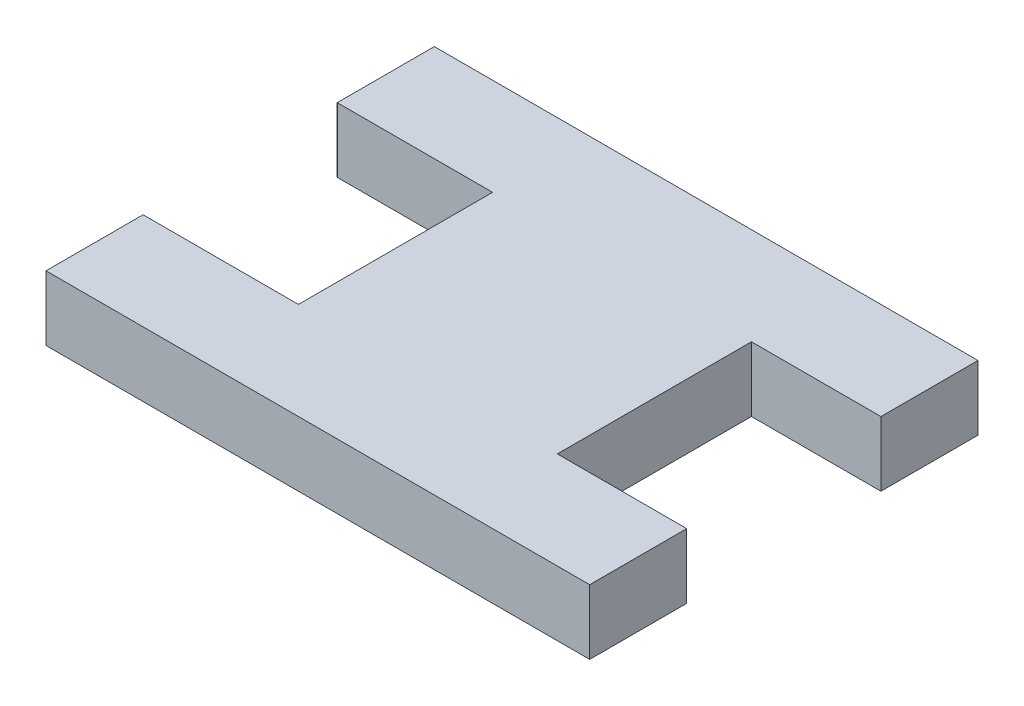
ISO-10303-21;
HEADER;
FILE_DESCRIPTION(('STEP AP214'),'2;1');
FILE_NAME('part.step','',(''),(''),'','','');
FILE_SCHEMA(('AUTOMOTIVE_DESIGN { 1 0 10303 214 1 1 1 1 }'));
ENDSEC;
DATA;
#1=APPLICATION_CONTEXT('core data for automotive mechanical design processes');
#2=APPLICATION_PROTOCOL_DEFINITION('international standard','automotive_design',2000,#1);
#3=PRODUCT_CONTEXT('',#1,'mechanical');
#4=PRODUCT('Part','Part','',(#3));
#5=PRODUCT_RELATED_PRODUCT_CATEGORY('part','',(#4));
#6=PRODUCT_DEFINITION_FORMATION('','',#4);
#7=PRODUCT_DEFINITION_CONTEXT('part definition',#1,'design');
#8=PRODUCT_DEFINITION('design','',#6,#7);
#9=PRODUCT_DEFINITION_SHAPE('','',#8);
#10=(LENGTH_UNIT() NAMED_UNIT(*) SI_UNIT(.MILLI.,.METRE.));
#11=(NAMED_UNIT(*) PLANE_ANGLE_UNIT() SI_UNIT($,.RADIAN.));
#12=(NAMED_UNIT(*) SI_UNIT($,.STERADIAN.) SOLID_ANGLE_UNIT());
#13=UNCERTAINTY_MEASURE_WITH_UNIT(LENGTH_MEASURE(1.E-05),#10,'distance_accuracy_value','');
#14=(GEOMETRIC_REPRESENTATION_CONTEXT(3) GLOBAL_UNCERTAINTY_ASSIGNED_CONTEXT((#13)) GLOBAL_UNIT_ASSIGNED_CONTEXT((#10,
#11,#12)) REPRESENTATION_CONTEXT('',''));
#15=CARTESIAN_POINT('',(0.,0.,0.));
#16=DIRECTION('',(0.,0.,1.));
#17=DIRECTION('',(1.,0.,0.));
#18=AXIS2_PLACEMENT_3D('',#15,#16,#17);
#19=CARTESIAN_POINT('',(0.,10.,0.));
#20=DIRECTION('',(0.,1.,0.));
#21=DIRECTION('',(0.,0.,1.));
#22=AXIS2_PLACEMENT_3D('',#19,#20,#21);
#23=PLANE('',#22);
#24=DIRECTION('',(0.,0.,1.));
#25=VECTOR('',#24,1.);
#26=CARTESIAN_POINT('',(-22.5,10.,-15.));
#27=LINE('',#26,#25);
#28=CARTESIAN_POINT('',(-22.5,10.,-15.));
#29=VERTEX_POINT('',#28);
#30=CARTESIAN_POINT('',(-22.5,10.,-7.5));
#31=VERTEX_POINT('',#30);
#32=EDGE_CURVE('E142',#29,#31,#27,.T.);
#33=ORIENTED_EDGE('',*,*,#32,.T.);
#34=DIRECTION('',(1.,0.,0.));
#35=VECTOR('',#34,1.);
#36=CARTESIAN_POINT('',(-22.5,10.,-7.5));
#37=LINE('',#36,#35);
#38=CARTESIAN_POINT('',(-10.5,10.,-7.50000000000001));
#39=VERTEX_POINT('',#38);
#40=EDGE_CURVE('E185',#31,#39,#37,.T.);
#41=ORIENTED_EDGE('',*,*,#40,.T.);
#42=DIRECTION('',(0.,0.,1.));
#43=VECTOR('',#42,1.);
#44=CARTESIAN_POINT('',(-10.5,10.,-7.50000000000001));
#45=LINE('',#44,#43);
#46=CARTESIAN_POINT('',(-10.5,10.,7.50000000000001));
#47=VERTEX_POINT('',#46);
#48=EDGE_CURVE('E182',#39,#47,#45,.T.);
#49=ORIENTED_EDGE('',*,*,#48,.T.);
#50=DIRECTION('',(-1.,0.,0.));
#51=VECTOR('',#50,1.);
#52=CARTESIAN_POINT('',(-22.5,10.,7.5));
#53=LINE('',#52,#51);
#54=CARTESIAN_POINT('',(-22.5,10.,7.5));
#55=VERTEX_POINT('',#54);
#56=EDGE_CURVE('E213',#47,#55,#53,.T.);
#57=ORIENTED_EDGE('',*,*,#56,.T.);
#58=DIRECTION('',(0.,0.,1.));
#59=VECTOR('',#58,1.);
#60=CARTESIAN_POINT('',(-22.5,10.,15.));
#61=LINE('',#60,#59);
#62=CARTESIAN_POINT('',(-22.5,10.,15.));
#63=VERTEX_POINT('',#62);
#64=EDGE_CURVE('E215',#55,#63,#61,.T.);
#65=ORIENTED_EDGE('',*,*,#64,.T.);
#66=DIRECTION('',(1.,0.,0.));
#67=VECTOR('',#66,1.);
#68=CARTESIAN_POINT('',(-22.5,10.,15.));
#69=LINE('',#68,#67);
#70=CARTESIAN_POINT('',(19.5,10.,15.));
#71=VERTEX_POINT('',#70);
#72=EDGE_CURVE('E217',#63,#71,#69,.T.);
#73=ORIENTED_EDGE('',*,*,#72,.T.);
#74=DIRECTION('',(0.,0.,-1.));
#75=VECTOR('',#74,1.);
#76=CARTESIAN_POINT('',(19.5,10.,15.));
#77=LINE('',#76,#75);
#78=CARTESIAN_POINT('',(19.5,10.,7.5));
#79=VERTEX_POINT('',#78);
#80=EDGE_CURVE('E219',#71,#79,#77,.T.);
#81=ORIENTED_EDGE('',*,*,#80,.T.);
#82=DIRECTION('',(-1.,0.,0.));
#83=VECTOR('',#82,1.);
#84=CARTESIAN_POINT('',(19.5,10.,7.5));
#85=LINE('',#84,#83);
#86=CARTESIAN_POINT('',(9.50000000000001,10.,7.5));
#87=VERTEX_POINT('',#86);
#88=EDGE_CURVE('E221',#79,#87,#85,.T.);
#89=ORIENTED_EDGE('',*,*,#88,.T.);
#90=DIRECTION('',(0.,0.,-1.));
#91=VECTOR('',#90,1.);
#92=CARTESIAN_POINT('',(9.50000000000001,10.,-7.5));
#93=LINE('',#92,#91);
#94=CARTESIAN_POINT('',(9.50000000000001,10.,-7.5));
#95=VERTEX_POINT('',#94);
#96=EDGE_CURVE('E223',#87,#95,#93,.T.);
#97=ORIENTED_EDGE('',*,*,#96,.T.);
#98=DIRECTION('',(1.,0.,0.));
#99=VECTOR('',#98,1.);
#100=CARTESIAN_POINT('',(19.5,10.,-7.5));
#101=LINE('',#100,#99);
#102=CARTESIAN_POINT('',(19.5,10.,-7.5));
#103=VERTEX_POINT('',#102);
#104=EDGE_CURVE('E225',#95,#103,#101,.T.);
#105=ORIENTED_EDGE('',*,*,#104,.T.);
#106=DIRECTION('',(0.,0.,-1.));
#107=VECTOR('',#106,1.);
#108=CARTESIAN_POINT('',(19.5,10.,-15.));
#109=LINE('',#108,#107);
#110=CARTESIAN_POINT('',(19.5,10.,-15.));
#111=VERTEX_POINT('',#110);
#112=EDGE_CURVE('E146',#103,#111,#109,.T.);
#113=ORIENTED_EDGE('',*,*,#112,.T.);
#114=DIRECTION('',(-1.,0.,0.));
#115=VECTOR('',#114,1.);
#116=CARTESIAN_POINT('',(-22.5,10.,-15.));
#117=LINE('',#116,#115);
#118=EDGE_CURVE('E60',#111,#29,#117,.T.);
#119=ORIENTED_EDGE('',*,*,#118,.T.);
#120=EDGE_LOOP('',(#33,#41,#49,#57,#65,#73,#81,#89,#97,#105,#113,#119));
#121=FACE_BOUND('',#120,.T.);
#122=ADVANCED_FACE('F37',(#121),#23,.T.);
#123=CARTESIAN_POINT('',(-22.5,10.,15.));
#124=DIRECTION('',(1.,0.,0.));
#125=DIRECTION('',(0.,0.,-1.));
#126=AXIS2_PLACEMENT_3D('',#123,#124,#125);
#127=PLANE('',#126);
#128=DIRECTION('',(0.,0.,1.));
#129=VECTOR('',#128,1.);
#130=CARTESIAN_POINT('',(-22.5,5.,15.));
#131=LINE('',#130,#129);
#132=CARTESIAN_POINT('',(-22.5,5.,7.5));
#133=VERTEX_POINT('',#132);
#134=CARTESIAN_POINT('',(-22.5,5.,15.));
#135=VERTEX_POINT('',#134);
#136=EDGE_CURVE('E192',#133,#135,#131,.T.);
#137=ORIENTED_EDGE('',*,*,#136,.T.);
#138=DIRECTION('',(0.,-1.,0.));
#139=VECTOR('',#138,1.);
#140=CARTESIAN_POINT('',(-22.5,10.,15.));
#141=LINE('',#140,#139);
#142=EDGE_CURVE('E166',#63,#135,#141,.T.);
#143=ORIENTED_EDGE('',*,*,#142,.F.);
#144=ORIENTED_EDGE('',*,*,#64,.F.);
#145=DIRECTION('',(0.,-1.,0.));
#146=VECTOR('',#145,1.);
#147=CARTESIAN_POINT('',(-22.5,10.,7.5));
#148=LINE('',#147,#146);
#149=EDGE_CURVE('E169',#55,#133,#148,.T.);
#150=ORIENTED_EDGE('',*,*,#149,.T.);
#151=EDGE_LOOP('',(#137,#143,#144,#150));
#152=FACE_BOUND('',#151,.T.);
#153=ADVANCED_FACE('F242',(#152),#127,.F.);
#154=CARTESIAN_POINT('',(-22.5,10.,7.5));
#155=DIRECTION('',(0.,0.,1.));
#156=DIRECTION('',(1.,0.,0.));
#157=AXIS2_PLACEMENT_3D('',#154,#155,#156);
#158=PLANE('',#157);
#159=DIRECTION('',(-1.,0.,0.));
#160=VECTOR('',#159,1.);
#161=CARTESIAN_POINT('',(-22.5,5.,7.5));
#162=LINE('',#161,#160);
#163=CARTESIAN_POINT('',(-10.5,5.,7.50000000000001));
#164=VERTEX_POINT('',#163);
#165=EDGE_CURVE('E187',#164,#133,#162,.T.);
#166=ORIENTED_EDGE('',*,*,#165,.T.);
#167=ORIENTED_EDGE('',*,*,#149,.F.);
#168=ORIENTED_EDGE('',*,*,#56,.F.);
#169=DIRECTION('',(0.,-1.,0.));
#170=VECTOR('',#169,1.);
#171=CARTESIAN_POINT('',(-10.5,10.,7.50000000000001));
#172=LINE('',#171,#170);
#173=EDGE_CURVE('E172',#47,#164,#172,.T.);
#174=ORIENTED_EDGE('',*,*,#173,.T.);
#175=EDGE_LOOP('',(#166,#167,#168,#174));
#176=FACE_BOUND('',#175,.T.);
#177=ADVANCED_FACE('F247',(#176),#158,.F.);
#178=CARTESIAN_POINT('',(-10.5,10.,-7.50000000000001));
#179=DIRECTION('',(1.,0.,0.));
#180=DIRECTION('',(0.,0.,-1.));
#181=AXIS2_PLACEMENT_3D('',#178,#179,#180);
#182=PLANE('',#181);
#183=DIRECTION('',(0.,0.,1.));
#184=VECTOR('',#183,1.);
#185=CARTESIAN_POINT('',(-10.5,5.,-7.50000000000001));
#186=LINE('',#185,#184);
#187=CARTESIAN_POINT('',(-10.5,5.,-7.50000000000001));
#188=VERTEX_POINT('',#187);
#189=EDGE_CURVE('E181',#188,#164,#186,.T.);
#190=ORIENTED_EDGE('',*,*,#189,.T.);
#191=ORIENTED_EDGE('',*,*,#173,.F.);
#192=ORIENTED_EDGE('',*,*,#48,.F.);
#193=DIRECTION('',(0.,-1.,0.));
#194=VECTOR('',#193,1.);
#195=CARTESIAN_POINT('',(-10.5,10.,-7.50000000000001));
#196=LINE('',#195,#194);
#197=EDGE_CURVE('E45',#39,#188,#196,.T.);
#198=ORIENTED_EDGE('',*,*,#197,.T.);
#199=EDGE_LOOP('',(#190,#191,#192,#198));
#200=FACE_BOUND('',#199,.T.);
#201=ADVANCED_FACE('F179',(#200),#182,.F.);
#202=CARTESIAN_POINT('',(-22.5,10.,-7.5));
#203=DIRECTION('',(0.,0.,-1.));
#204=DIRECTION('',(-1.,0.,0.));
#205=AXIS2_PLACEMENT_3D('',#202,#203,#204);
#206=PLANE('',#205);
#207=DIRECTION('',(1.,0.,0.));
#208=VECTOR('',#207,1.);
#209=CARTESIAN_POINT('',(-22.5,5.,-7.5));
#210=LINE('',#209,#208);
#211=CARTESIAN_POINT('',(-22.5,5.,-7.5));
#212=VERTEX_POINT('',#211);
#213=EDGE_CURVE('E128',#212,#188,#210,.T.);
#214=ORIENTED_EDGE('',*,*,#213,.T.);
#215=ORIENTED_EDGE('',*,*,#197,.F.);
#216=ORIENTED_EDGE('',*,*,#40,.F.);
#217=DIRECTION('',(0.,-1.,0.));
#218=VECTOR('',#217,1.);
#219=CARTESIAN_POINT('',(-22.5,10.,-7.5));
#220=LINE('',#219,#218);
#221=EDGE_CURVE('E11',#31,#212,#220,.T.);
#222=ORIENTED_EDGE('',*,*,#221,.T.);
#223=EDGE_LOOP('',(#214,#215,#216,#222));
#224=FACE_BOUND('',#223,.T.);
#225=ADVANCED_FACE('F184',(#224),#206,.F.);
#226=CARTESIAN_POINT('',(-22.5,10.,-15.));
#227=DIRECTION('',(1.,0.,0.));
#228=DIRECTION('',(0.,0.,-1.));
#229=AXIS2_PLACEMENT_3D('',#226,#227,#228);
#230=PLANE('',#229);
#231=DIRECTION('',(0.,0.,1.));
#232=VECTOR('',#231,1.);
#233=CARTESIAN_POINT('',(-22.5,5.,-15.));
#234=LINE('',#233,#232);
#235=CARTESIAN_POINT('',(-22.5,5.,-15.));
#236=VERTEX_POINT('',#235);
#237=EDGE_CURVE('E125',#236,#212,#234,.T.);
#238=ORIENTED_EDGE('',*,*,#237,.T.);
#239=ORIENTED_EDGE('',*,*,#221,.F.);
#240=ORIENTED_EDGE('',*,*,#32,.F.);
#241=DIRECTION('',(0.,-1.,0.));
#242=VECTOR('',#241,1.);
#243=CARTESIAN_POINT('',(-22.5,10.,-15.));
#244=LINE('',#243,#242);
#245=EDGE_CURVE('E135',#29,#236,#244,.T.);
#246=ORIENTED_EDGE('',*,*,#245,.T.);
#247=EDGE_LOOP('',(#238,#239,#240,#246));
#248=FACE_BOUND('',#247,.T.);
#249=ADVANCED_FACE('F141',(#248),#230,.F.);
#250=CARTESIAN_POINT('',(19.5,10.,-15.));
#251=DIRECTION('',(-1.,0.,0.));
#252=DIRECTION('',(0.,0.,1.));
#253=AXIS2_PLACEMENT_3D('',#250,#251,#252);
#254=PLANE('',#253);
#255=DIRECTION('',(0.,0.,-1.));
#256=VECTOR('',#255,1.);
#257=CARTESIAN_POINT('',(19.5,5.,-15.));
#258=LINE('',#257,#256);
#259=CARTESIAN_POINT('',(19.5,5.,-7.5));
#260=VERTEX_POINT('',#259);
#261=CARTESIAN_POINT('',(19.5,5.,-15.));
#262=VERTEX_POINT('',#261);
#263=EDGE_CURVE('E149',#260,#262,#258,.T.);
#264=ORIENTED_EDGE('',*,*,#263,.T.);
#265=DIRECTION('',(0.,-1.,0.));
#266=VECTOR('',#265,1.);
#267=CARTESIAN_POINT('',(19.5,10.,-15.));
#268=LINE('',#267,#266);
#269=EDGE_CURVE('E138',#111,#262,#268,.T.);
#270=ORIENTED_EDGE('',*,*,#269,.F.);
#271=ORIENTED_EDGE('',*,*,#112,.F.);
#272=DIRECTION('',(0.,-1.,0.));
#273=VECTOR('',#272,1.);
#274=CARTESIAN_POINT('',(19.5,10.,-7.5));
#275=LINE('',#274,#273);
#276=EDGE_CURVE('E144',#103,#260,#275,.T.);
#277=ORIENTED_EDGE('',*,*,#276,.T.);
#278=EDGE_LOOP('',(#264,#270,#271,#277));
#279=FACE_BOUND('',#278,.T.);
#280=ADVANCED_FACE('F229',(#279),#254,.F.);
#281=CARTESIAN_POINT('',(19.5,10.,-7.5));
#282=DIRECTION('',(0.,0.,-1.));
#283=DIRECTION('',(-1.,0.,0.));
#284=AXIS2_PLACEMENT_3D('',#281,#282,#283);
#285=PLANE('',#284);
#286=DIRECTION('',(1.,0.,0.));
#287=VECTOR('',#286,1.);
#288=CARTESIAN_POINT('',(19.5,5.,-7.5));
#289=LINE('',#288,#287);
#290=CARTESIAN_POINT('',(9.50000000000001,5.,-7.5));
#291=VERTEX_POINT('',#290);
#292=EDGE_CURVE('E203',#291,#260,#289,.T.);
#293=ORIENTED_EDGE('',*,*,#292,.T.);
#294=ORIENTED_EDGE('',*,*,#276,.F.);
#295=ORIENTED_EDGE('',*,*,#104,.F.);
#296=DIRECTION('',(0.,-1.,0.));
#297=VECTOR('',#296,1.);
#298=CARTESIAN_POINT('',(9.50000000000001,10.,-7.5));
#299=LINE('',#298,#297);
#300=EDGE_CURVE('E154',#95,#291,#299,.T.);
#301=ORIENTED_EDGE('',*,*,#300,.T.);
#302=EDGE_LOOP('',(#293,#294,#295,#301));
#303=FACE_BOUND('',#302,.T.);
#304=ADVANCED_FACE('F231',(#303),#285,.F.);
#305=CARTESIAN_POINT('',(9.50000000000001,10.,-7.5));
#306=DIRECTION('',(-1.,0.,0.));
#307=DIRECTION('',(0.,0.,1.));
#308=AXIS2_PLACEMENT_3D('',#305,#306,#307);
#309=PLANE('',#308);
#310=DIRECTION('',(0.,0.,-1.));
#311=VECTOR('',#310,1.);
#312=CARTESIAN_POINT('',(9.50000000000001,5.,-7.5));
#313=LINE('',#312,#311);
#314=CARTESIAN_POINT('',(9.50000000000001,5.,7.5));
#315=VERTEX_POINT('',#314);
#316=EDGE_CURVE('E201',#315,#291,#313,.T.);
#317=ORIENTED_EDGE('',*,*,#316,.T.);
#318=ORIENTED_EDGE('',*,*,#300,.F.);
#319=ORIENTED_EDGE('',*,*,#96,.F.);
#320=DIRECTION('',(0.,-1.,0.));
#321=VECTOR('',#320,1.);
#322=CARTESIAN_POINT('',(9.50000000000001,10.,7.5));
#323=LINE('',#322,#321);
#324=EDGE_CURVE('E157',#87,#315,#323,.T.);
#325=ORIENTED_EDGE('',*,*,#324,.T.);
#326=EDGE_LOOP('',(#317,#318,#319,#325));
#327=FACE_BOUND('',#326,.T.);
#328=ADVANCED_FACE('F237',(#327),#309,.F.);
#329=CARTESIAN_POINT('',(19.5,10.,7.5));
#330=DIRECTION('',(0.,0.,1.));
#331=DIRECTION('',(1.,0.,0.));
#332=AXIS2_PLACEMENT_3D('',#329,#330,#331);
#333=PLANE('',#332);
#334=DIRECTION('',(-1.,0.,0.));
#335=VECTOR('',#334,1.);
#336=CARTESIAN_POINT('',(19.5,5.,7.5));
#337=LINE('',#336,#335);
#338=CARTESIAN_POINT('',(19.5,5.,7.5));
#339=VERTEX_POINT('',#338);
#340=EDGE_CURVE('E198',#339,#315,#337,.T.);
#341=ORIENTED_EDGE('',*,*,#340,.T.);
#342=ORIENTED_EDGE('',*,*,#324,.F.);
#343=ORIENTED_EDGE('',*,*,#88,.F.);
#344=DIRECTION('',(0.,-1.,0.));
#345=VECTOR('',#344,1.);
#346=CARTESIAN_POINT('',(19.5,10.,7.5));
#347=LINE('',#346,#345);
#348=EDGE_CURVE('E160',#79,#339,#347,.T.);
#349=ORIENTED_EDGE('',*,*,#348,.T.);
#350=EDGE_LOOP('',(#341,#342,#343,#349));
#351=FACE_BOUND('',#350,.T.);
#352=ADVANCED_FACE('F263',(#351),#333,.F.);
#353=CARTESIAN_POINT('',(19.5,10.,15.));
#354=DIRECTION('',(-1.,0.,0.));
#355=DIRECTION('',(0.,0.,1.));
#356=AXIS2_PLACEMENT_3D('',#353,#354,#355);
#357=PLANE('',#356);
#358=DIRECTION('',(0.,0.,-1.));
#359=VECTOR('',#358,1.);
#360=CARTESIAN_POINT('',(19.5,5.,15.));
#361=LINE('',#360,#359);
#362=CARTESIAN_POINT('',(19.5,5.,15.));
#363=VERTEX_POINT('',#362);
#364=EDGE_CURVE('E195',#363,#339,#361,.T.);
#365=ORIENTED_EDGE('',*,*,#364,.T.);
#366=ORIENTED_EDGE('',*,*,#348,.F.);
#367=ORIENTED_EDGE('',*,*,#80,.F.);
#368=DIRECTION('',(0.,-1.,0.));
#369=VECTOR('',#368,1.);
#370=CARTESIAN_POINT('',(19.5,10.,15.));
#371=LINE('',#370,#369);
#372=EDGE_CURVE('E163',#71,#363,#371,.T.);
#373=ORIENTED_EDGE('',*,*,#372,.T.);
#374=EDGE_LOOP('',(#365,#366,#367,#373));
#375=FACE_BOUND('',#374,.T.);
#376=ADVANCED_FACE('F258',(#375),#357,.F.);
#377=CARTESIAN_POINT('',(-47.5,5.,15.));
#378=DIRECTION('',(0.,0.,-1.));
#379=DIRECTION('',(-1.,0.,0.));
#380=AXIS2_PLACEMENT_3D('',#377,#378,#379);
#381=PLANE('',#380);
#382=DIRECTION('',(-1.,0.,0.));
#383=VECTOR('',#382,1.);
#384=CARTESIAN_POINT('',(37.5,5.,15.));
#385=LINE('',#384,#383);
#386=EDGE_CURVE('E139',#363,#135,#385,.T.);
#387=ORIENTED_EDGE('',*,*,#386,.F.);
#388=ORIENTED_EDGE('',*,*,#372,.F.);
#389=ORIENTED_EDGE('',*,*,#72,.F.);
#390=ORIENTED_EDGE('',*,*,#142,.T.);
#391=EDGE_LOOP('',(#387,#388,#389,#390));
#392=FACE_BOUND('',#391,.T.);
#393=ADVANCED_FACE('F254',(#392),#381,.F.);
#394=CARTESIAN_POINT('',(-47.5,5.,-15.));
#395=DIRECTION('',(0.,0.,1.));
#396=DIRECTION('',(1.,0.,0.));
#397=AXIS2_PLACEMENT_3D('',#394,#395,#396);
#398=PLANE('',#397);
#399=DIRECTION('',(1.,0.,0.));
#400=VECTOR('',#399,1.);
#401=CARTESIAN_POINT('',(-37.5,5.,-15.));
#402=LINE('',#401,#400);
#403=EDGE_CURVE('E52',#236,#262,#402,.T.);
#404=ORIENTED_EDGE('',*,*,#403,.F.);
#405=ORIENTED_EDGE('',*,*,#245,.F.);
#406=ORIENTED_EDGE('',*,*,#118,.F.);
#407=ORIENTED_EDGE('',*,*,#269,.T.);
#408=EDGE_LOOP('',(#404,#405,#406,#407));
#409=FACE_BOUND('',#408,.T.);
#410=ADVANCED_FACE('F39',(#409),#398,.F.);
#411=CARTESIAN_POINT('',(0.,5.,0.));
#412=DIRECTION('',(0.,1.,0.));
#413=DIRECTION('',(0.,0.,1.));
#414=AXIS2_PLACEMENT_3D('',#411,#412,#413);
#415=PLANE('',#414);
#416=ORIENTED_EDGE('',*,*,#237,.F.);
#417=ORIENTED_EDGE('',*,*,#403,.T.);
#418=ORIENTED_EDGE('',*,*,#263,.F.);
#419=ORIENTED_EDGE('',*,*,#292,.F.);
#420=ORIENTED_EDGE('',*,*,#316,.F.);
#421=ORIENTED_EDGE('',*,*,#340,.F.);
#422=ORIENTED_EDGE('',*,*,#364,.F.);
#423=ORIENTED_EDGE('',*,*,#386,.T.);
#424=ORIENTED_EDGE('',*,*,#136,.F.);
#425=ORIENTED_EDGE('',*,*,#165,.F.);
#426=ORIENTED_EDGE('',*,*,#189,.F.);
#427=ORIENTED_EDGE('',*,*,#213,.F.);
#428=EDGE_LOOP('',(#416,#417,#418,#419,#420,#421,#422,#423,#424,#425,#426,#427));
#429=FACE_BOUND('',#428,.T.);
#430=ADVANCED_FACE('F126',(#429),#415,.F.);
#431=CLOSED_SHELL('',(#122,#153,#177,#201,#225,#249,#280,#304,#328,#352,#376,#393,#410,#430));
#432=MANIFOLD_SOLID_BREP('B2',#431);
#433=ADVANCED_BREP_SHAPE_REPRESENTATION('',(#18,#432),#14);
#434=SHAPE_DEFINITION_REPRESENTATION(#9,#433);
ENDSEC;
END-ISO-10303-21;
